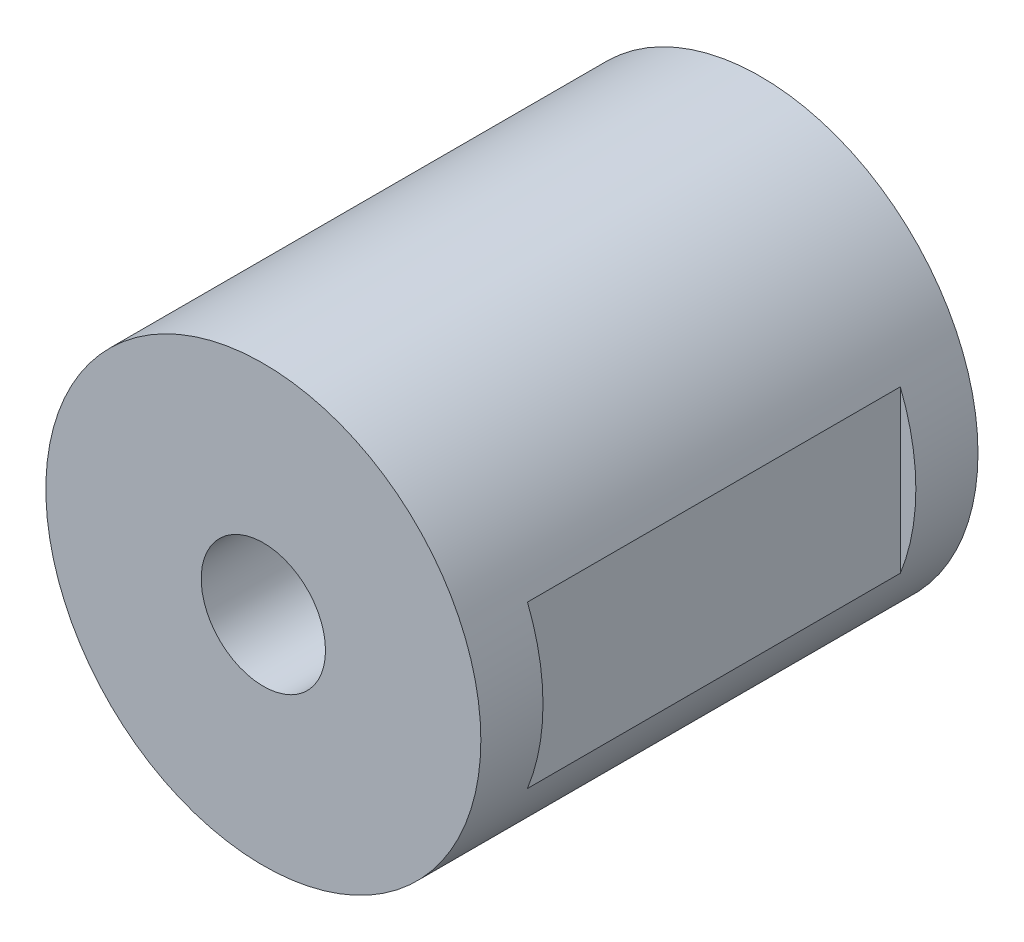
ISO-10303-21;
HEADER;
FILE_DESCRIPTION(('STEP AP214'),'2;1');
FILE_NAME('part.step','',(''),(''),'','','');
FILE_SCHEMA(('AUTOMOTIVE_DESIGN { 1 0 10303 214 1 1 1 1 }'));
ENDSEC;
DATA;
#1=APPLICATION_CONTEXT('core data for automotive mechanical design processes');
#2=APPLICATION_PROTOCOL_DEFINITION('international standard','automotive_design',2000,#1);
#3=PRODUCT_CONTEXT('',#1,'mechanical');
#4=PRODUCT('Part','Part','',(#3));
#5=PRODUCT_RELATED_PRODUCT_CATEGORY('part','',(#4));
#6=PRODUCT_DEFINITION_FORMATION('','',#4);
#7=PRODUCT_DEFINITION_CONTEXT('part definition',#1,'design');
#8=PRODUCT_DEFINITION('design','',#6,#7);
#9=PRODUCT_DEFINITION_SHAPE('','',#8);
#10=(LENGTH_UNIT() NAMED_UNIT(*) SI_UNIT(.MILLI.,.METRE.));
#11=(NAMED_UNIT(*) PLANE_ANGLE_UNIT() SI_UNIT($,.RADIAN.));
#12=(NAMED_UNIT(*) SI_UNIT($,.STERADIAN.) SOLID_ANGLE_UNIT());
#13=UNCERTAINTY_MEASURE_WITH_UNIT(LENGTH_MEASURE(1.E-05),#10,'distance_accuracy_value','');
#14=(GEOMETRIC_REPRESENTATION_CONTEXT(3) GLOBAL_UNCERTAINTY_ASSIGNED_CONTEXT((#13)) GLOBAL_UNIT_ASSIGNED_CONTEXT((#10,
#11,#12)) REPRESENTATION_CONTEXT('',''));
#15=CARTESIAN_POINT('',(0.,0.,0.));
#16=DIRECTION('',(0.,0.,1.));
#17=DIRECTION('',(1.,0.,0.));
#18=AXIS2_PLACEMENT_3D('',#15,#16,#17);
#19=CARTESIAN_POINT('',(0.,0.,80.));
#20=DIRECTION('',(0.,0.,-1.));
#21=DIRECTION('',(-1.,0.,0.));
#22=AXIS2_PLACEMENT_3D('',#19,#20,#21);
#23=CYLINDRICAL_SURFACE('',#22,35.);
#24=DIRECTION('',(0.,0.,-1.));
#25=VECTOR('',#24,1.);
#26=CARTESIAN_POINT('',(-18.0277563773199,-30.,80.));
#27=LINE('',#26,#25);
#28=CARTESIAN_POINT('',(-18.0277563773199,-30.,60.));
#29=VERTEX_POINT('',#28);
#30=CARTESIAN_POINT('',(-18.0277563773199,-30.,20.));
#31=VERTEX_POINT('',#30);
#32=EDGE_CURVE('E11',#29,#31,#27,.T.);
#33=ORIENTED_EDGE('',*,*,#32,.F.);
#34=CARTESIAN_POINT('',(0.,0.,60.));
#35=DIRECTION('',(0.,0.,1.));
#36=DIRECTION('',(1.,0.,0.));
#37=AXIS2_PLACEMENT_3D('',#34,#35,#36);
#38=CIRCLE('',#37,35.);
#39=CARTESIAN_POINT('',(18.0277563773199,-30.,60.));
#40=VERTEX_POINT('',#39);
#41=EDGE_CURVE('E93',#29,#40,#38,.T.);
#42=ORIENTED_EDGE('',*,*,#41,.T.);
#43=DIRECTION('',(0.,0.,-1.));
#44=VECTOR('',#43,1.);
#45=CARTESIAN_POINT('',(18.0277563773199,-30.,80.));
#46=LINE('',#45,#44);
#47=CARTESIAN_POINT('',(18.0277563773199,-30.,20.));
#48=VERTEX_POINT('',#47);
#49=EDGE_CURVE('E40',#48,#40,#46,.F.);
#50=ORIENTED_EDGE('',*,*,#49,.F.);
#51=CARTESIAN_POINT('',(0.,0.,20.));
#52=DIRECTION('',(0.,0.,-1.));
#53=DIRECTION('',(-1.,0.,0.));
#54=AXIS2_PLACEMENT_3D('',#51,#52,#53);
#55=CIRCLE('',#54,35.);
#56=EDGE_CURVE('E46',#48,#31,#55,.T.);
#57=ORIENTED_EDGE('',*,*,#56,.T.);
#58=EDGE_LOOP('',(#33,#42,#50,#57));
#59=FACE_BOUND('',#58,.T.);
#60=CARTESIAN_POINT('',(0.,0.,70.));
#61=DIRECTION('',(0.,0.,1.));
#62=DIRECTION('',(1.,0.,0.));
#63=AXIS2_PLACEMENT_3D('',#60,#61,#62);
#64=CIRCLE('',#63,35.);
#65=CARTESIAN_POINT('',(32.5001523073354,-12.99,70.));
#66=VERTEX_POINT('',#65);
#67=CARTESIAN_POINT('',(32.5001523073354,12.99,70.));
#68=VERTEX_POINT('',#67);
#69=EDGE_CURVE('E109',#66,#68,#64,.T.);
#70=ORIENTED_EDGE('',*,*,#69,.T.);
#71=DIRECTION('',(0.,0.,-1.));
#72=VECTOR('',#71,1.);
#73=CARTESIAN_POINT('',(32.5001523073354,12.99,80.));
#74=LINE('',#73,#72);
#75=CARTESIAN_POINT('',(32.5001523073354,12.99,10.));
#76=VERTEX_POINT('',#75);
#77=EDGE_CURVE('E100',#68,#76,#74,.T.);
#78=ORIENTED_EDGE('',*,*,#77,.T.);
#79=CARTESIAN_POINT('',(0.,0.,9.99999999999999));
#80=DIRECTION('',(0.,0.,-1.));
#81=DIRECTION('',(0.,1.,0.));
#82=AXIS2_PLACEMENT_3D('',#79,#80,#81);
#83=CIRCLE('',#82,35.);
#84=CARTESIAN_POINT('',(32.5001523073354,-12.99,10.));
#85=VERTEX_POINT('',#84);
#86=EDGE_CURVE('E54',#76,#85,#83,.T.);
#87=ORIENTED_EDGE('',*,*,#86,.T.);
#88=DIRECTION('',(0.,0.,-1.));
#89=VECTOR('',#88,1.);
#90=CARTESIAN_POINT('',(32.5001523073354,-12.99,80.));
#91=LINE('',#90,#89);
#92=EDGE_CURVE('E106',#85,#66,#91,.F.);
#93=ORIENTED_EDGE('',*,*,#92,.T.);
#94=EDGE_LOOP('',(#70,#78,#87,#93));
#95=FACE_BOUND('',#94,.T.);
#96=CARTESIAN_POINT('',(0.,0.,80.));
#97=DIRECTION('',(0.,0.,1.));
#98=DIRECTION('',(1.,0.,0.));
#99=AXIS2_PLACEMENT_3D('',#96,#97,#98);
#100=CIRCLE('',#99,35.);
#101=CARTESIAN_POINT('',(35.,0.,80.));
#102=VERTEX_POINT('',#101);
#103=EDGE_CURVE('E111',#102,#102,#100,.T.);
#104=ORIENTED_EDGE('',*,*,#103,.F.);
#105=EDGE_LOOP('',(#104));
#106=FACE_BOUND('',#105,.T.);
#107=CARTESIAN_POINT('',(0.,0.,0.));
#108=DIRECTION('',(0.,0.,1.));
#109=DIRECTION('',(1.,0.,0.));
#110=AXIS2_PLACEMENT_3D('',#107,#108,#109);
#111=CIRCLE('',#110,35.);
#112=CARTESIAN_POINT('',(35.,0.,0.));
#113=VERTEX_POINT('',#112);
#114=EDGE_CURVE('E112',#113,#113,#111,.T.);
#115=ORIENTED_EDGE('',*,*,#114,.T.);
#116=EDGE_LOOP('',(#115));
#117=FACE_BOUND('',#116,.T.);
#118=ADVANCED_FACE('F33',(#59,#95,#106,#117),#23,.T.);
#119=CARTESIAN_POINT('',(0.,0.,80.));
#120=DIRECTION('',(0.,0.,1.));
#121=DIRECTION('',(1.,0.,0.));
#122=AXIS2_PLACEMENT_3D('',#119,#120,#121);
#123=PLANE('',#122);
#124=CARTESIAN_POINT('',(0.,0.,80.));
#125=DIRECTION('',(0.,0.,1.));
#126=DIRECTION('',(1.,0.,0.));
#127=AXIS2_PLACEMENT_3D('',#124,#125,#126);
#128=CIRCLE('',#127,10.);
#129=CARTESIAN_POINT('',(10.,0.,80.));
#130=VERTEX_POINT('',#129);
#131=EDGE_CURVE('E118',#130,#130,#128,.T.);
#132=ORIENTED_EDGE('',*,*,#131,.F.);
#133=EDGE_LOOP('',(#132));
#134=FACE_BOUND('',#133,.T.);
#135=ORIENTED_EDGE('',*,*,#103,.T.);
#136=EDGE_LOOP('',(#135));
#137=FACE_BOUND('',#136,.T.);
#138=ADVANCED_FACE('F160',(#134,#137),#123,.T.);
#139=CARTESIAN_POINT('',(0.,0.,0.));
#140=DIRECTION('',(0.,0.,1.));
#141=DIRECTION('',(1.,0.,0.));
#142=AXIS2_PLACEMENT_3D('',#139,#140,#141);
#143=PLANE('',#142);
#144=CARTESIAN_POINT('',(0.,0.,0.));
#145=DIRECTION('',(0.,0.,1.));
#146=DIRECTION('',(1.,0.,0.));
#147=AXIS2_PLACEMENT_3D('',#144,#145,#146);
#148=CIRCLE('',#147,10.);
#149=CARTESIAN_POINT('',(10.,0.,0.));
#150=VERTEX_POINT('',#149);
#151=EDGE_CURVE('E115',#150,#150,#148,.T.);
#152=ORIENTED_EDGE('',*,*,#151,.T.);
#153=EDGE_LOOP('',(#152));
#154=FACE_BOUND('',#153,.T.);
#155=ORIENTED_EDGE('',*,*,#114,.F.);
#156=EDGE_LOOP('',(#155));
#157=FACE_BOUND('',#156,.T.);
#158=ADVANCED_FACE('F165',(#154,#157),#143,.F.);
#159=CARTESIAN_POINT('',(0.,0.,0.));
#160=DIRECTION('',(0.,0.,1.));
#161=DIRECTION('',(1.,0.,0.));
#162=AXIS2_PLACEMENT_3D('',#159,#160,#161);
#163=CYLINDRICAL_SURFACE('',#162,10.);
#164=ORIENTED_EDGE('',*,*,#151,.F.);
#165=EDGE_LOOP('',(#164));
#166=FACE_BOUND('',#165,.T.);
#167=ORIENTED_EDGE('',*,*,#131,.T.);
#168=EDGE_LOOP('',(#167));
#169=FACE_BOUND('',#168,.T.);
#170=ADVANCED_FACE('F167',(#166,#169),#163,.F.);
#171=CARTESIAN_POINT('',(32.5,12.99,10.));
#172=DIRECTION('',(0.,0.,-1.));
#173=DIRECTION('',(0.,1.,0.));
#174=AXIS2_PLACEMENT_3D('',#171,#172,#173);
#175=PLANE('',#174);
#176=DIRECTION('',(1.,0.,0.));
#177=VECTOR('',#176,1.);
#178=CARTESIAN_POINT('',(32.5,12.99,10.));
#179=LINE('',#178,#177);
#180=CARTESIAN_POINT('',(32.5,12.99,10.));
#181=VERTEX_POINT('',#180);
#182=EDGE_CURVE('E124',#181,#76,#179,.T.);
#183=ORIENTED_EDGE('',*,*,#182,.F.);
#184=DIRECTION('',(0.,1.,0.));
#185=VECTOR('',#184,1.);
#186=CARTESIAN_POINT('',(32.5,12.99,10.));
#187=LINE('',#186,#185);
#188=CARTESIAN_POINT('',(32.5,-12.99,10.));
#189=VERTEX_POINT('',#188);
#190=EDGE_CURVE('E96',#189,#181,#187,.T.);
#191=ORIENTED_EDGE('',*,*,#190,.F.);
#192=DIRECTION('',(1.,0.,0.));
#193=VECTOR('',#192,1.);
#194=CARTESIAN_POINT('',(32.5,-12.99,10.));
#195=LINE('',#194,#193);
#196=EDGE_CURVE('E121',#189,#85,#195,.T.);
#197=ORIENTED_EDGE('',*,*,#196,.T.);
#198=ORIENTED_EDGE('',*,*,#86,.F.);
#199=EDGE_LOOP('',(#183,#191,#197,#198));
#200=FACE_BOUND('',#199,.T.);
#201=ADVANCED_FACE('F149',(#200),#175,.F.);
#202=CARTESIAN_POINT('',(32.5,-12.99,70.));
#203=DIRECTION('',(0.,-1.,0.));
#204=DIRECTION('',(0.,0.,-1.));
#205=AXIS2_PLACEMENT_3D('',#202,#203,#204);
#206=PLANE('',#205);
#207=ORIENTED_EDGE('',*,*,#196,.F.);
#208=DIRECTION('',(0.,0.,-1.));
#209=VECTOR('',#208,1.);
#210=CARTESIAN_POINT('',(32.5,-12.99,70.));
#211=LINE('',#210,#209);
#212=CARTESIAN_POINT('',(32.5,-12.99,70.));
#213=VERTEX_POINT('',#212);
#214=EDGE_CURVE('E127',#213,#189,#211,.T.);
#215=ORIENTED_EDGE('',*,*,#214,.F.);
#216=DIRECTION('',(1.,0.,0.));
#217=VECTOR('',#216,1.);
#218=CARTESIAN_POINT('',(32.5,-12.99,70.));
#219=LINE('',#218,#217);
#220=EDGE_CURVE('E130',#213,#66,#219,.T.);
#221=ORIENTED_EDGE('',*,*,#220,.T.);
#222=ORIENTED_EDGE('',*,*,#92,.F.);
#223=EDGE_LOOP('',(#207,#215,#221,#222));
#224=FACE_BOUND('',#223,.T.);
#225=ADVANCED_FACE('F157',(#224),#206,.F.);
#226=CARTESIAN_POINT('',(32.5,12.99,70.));
#227=DIRECTION('',(0.,0.,1.));
#228=DIRECTION('',(1.,0.,0.));
#229=AXIS2_PLACEMENT_3D('',#226,#227,#228);
#230=PLANE('',#229);
#231=ORIENTED_EDGE('',*,*,#69,.F.);
#232=ORIENTED_EDGE('',*,*,#220,.F.);
#233=DIRECTION('',(0.,-1.,0.));
#234=VECTOR('',#233,1.);
#235=CARTESIAN_POINT('',(32.5,12.99,70.));
#236=LINE('',#235,#234);
#237=CARTESIAN_POINT('',(32.5,12.99,70.));
#238=VERTEX_POINT('',#237);
#239=EDGE_CURVE('E136',#238,#213,#236,.T.);
#240=ORIENTED_EDGE('',*,*,#239,.F.);
#241=DIRECTION('',(1.,0.,0.));
#242=VECTOR('',#241,1.);
#243=CARTESIAN_POINT('',(32.5,12.99,70.));
#244=LINE('',#243,#242);
#245=EDGE_CURVE('E126',#238,#68,#244,.T.);
#246=ORIENTED_EDGE('',*,*,#245,.T.);
#247=EDGE_LOOP('',(#231,#232,#240,#246));
#248=FACE_BOUND('',#247,.T.);
#249=ADVANCED_FACE('F155',(#248),#230,.F.);
#250=CARTESIAN_POINT('',(32.5,12.99,70.));
#251=DIRECTION('',(0.,1.,0.));
#252=DIRECTION('',(0.,0.,1.));
#253=AXIS2_PLACEMENT_3D('',#250,#251,#252);
#254=PLANE('',#253);
#255=ORIENTED_EDGE('',*,*,#245,.F.);
#256=DIRECTION('',(0.,0.,1.));
#257=VECTOR('',#256,1.);
#258=CARTESIAN_POINT('',(32.5,12.99,70.));
#259=LINE('',#258,#257);
#260=EDGE_CURVE('E139',#181,#238,#259,.T.);
#261=ORIENTED_EDGE('',*,*,#260,.F.);
#262=ORIENTED_EDGE('',*,*,#182,.T.);
#263=ORIENTED_EDGE('',*,*,#77,.F.);
#264=EDGE_LOOP('',(#255,#261,#262,#263));
#265=FACE_BOUND('',#264,.T.);
#266=ADVANCED_FACE('F152',(#265),#254,.F.);
#267=CARTESIAN_POINT('',(32.5,0.,0.));
#268=DIRECTION('',(1.,0.,0.));
#269=DIRECTION('',(0.,0.,-1.));
#270=AXIS2_PLACEMENT_3D('',#267,#268,#269);
#271=PLANE('',#270);
#272=ORIENTED_EDGE('',*,*,#190,.T.);
#273=ORIENTED_EDGE('',*,*,#260,.T.);
#274=ORIENTED_EDGE('',*,*,#239,.T.);
#275=ORIENTED_EDGE('',*,*,#214,.T.);
#276=EDGE_LOOP('',(#272,#273,#274,#275));
#277=FACE_BOUND('',#276,.T.);
#278=ADVANCED_FACE('F146',(#277),#271,.T.);
#279=CARTESIAN_POINT('',(18.03,-30.,60.));
#280=DIRECTION('',(0.,0.,1.));
#281=DIRECTION('',(1.,0.,0.));
#282=AXIS2_PLACEMENT_3D('',#279,#280,#281);
#283=PLANE('',#282);
#284=DIRECTION('',(-1.,0.,0.));
#285=VECTOR('',#284,1.);
#286=CARTESIAN_POINT('',(18.03,-30.,60.));
#287=LINE('',#286,#285);
#288=EDGE_CURVE('E88',#40,#29,#287,.T.);
#289=ORIENTED_EDGE('',*,*,#288,.F.);
#290=ORIENTED_EDGE('',*,*,#41,.F.);
#291=EDGE_LOOP('',(#289,#290));
#292=FACE_BOUND('',#291,.T.);
#293=ADVANCED_FACE('F95',(#292),#283,.F.);
#294=CARTESIAN_POINT('',(18.03,-30.,20.));
#295=DIRECTION('',(0.,0.,-1.));
#296=DIRECTION('',(-1.,0.,0.));
#297=AXIS2_PLACEMENT_3D('',#294,#295,#296);
#298=PLANE('',#297);
#299=DIRECTION('',(1.,0.,0.));
#300=VECTOR('',#299,1.);
#301=CARTESIAN_POINT('',(18.03,-30.,20.));
#302=LINE('',#301,#300);
#303=EDGE_CURVE('E90',#31,#48,#302,.T.);
#304=ORIENTED_EDGE('',*,*,#303,.F.);
#305=ORIENTED_EDGE('',*,*,#56,.F.);
#306=EDGE_LOOP('',(#304,#305));
#307=FACE_BOUND('',#306,.T.);
#308=ADVANCED_FACE('F188',(#307),#298,.F.);
#309=CARTESIAN_POINT('',(0.,-30.,0.));
#310=DIRECTION('',(0.,-1.,0.));
#311=DIRECTION('',(0.,0.,-1.));
#312=AXIS2_PLACEMENT_3D('',#309,#310,#311);
#313=PLANE('',#312);
#314=ORIENTED_EDGE('',*,*,#32,.T.);
#315=ORIENTED_EDGE('',*,*,#303,.T.);
#316=ORIENTED_EDGE('',*,*,#49,.T.);
#317=ORIENTED_EDGE('',*,*,#288,.T.);
#318=EDGE_LOOP('',(#314,#315,#316,#317));
#319=FACE_BOUND('',#318,.T.);
#320=ADVANCED_FACE('F87',(#319),#313,.T.);
#321=CLOSED_SHELL('',(#118,#138,#158,#170,#201,#225,#249,#266,#278,#293,#308,#320));
#322=MANIFOLD_SOLID_BREP('B2',#321);
#323=ADVANCED_BREP_SHAPE_REPRESENTATION('',(#18,#322),#14);
#324=SHAPE_DEFINITION_REPRESENTATION(#9,#323);
ENDSEC;
END-ISO-10303-21;
